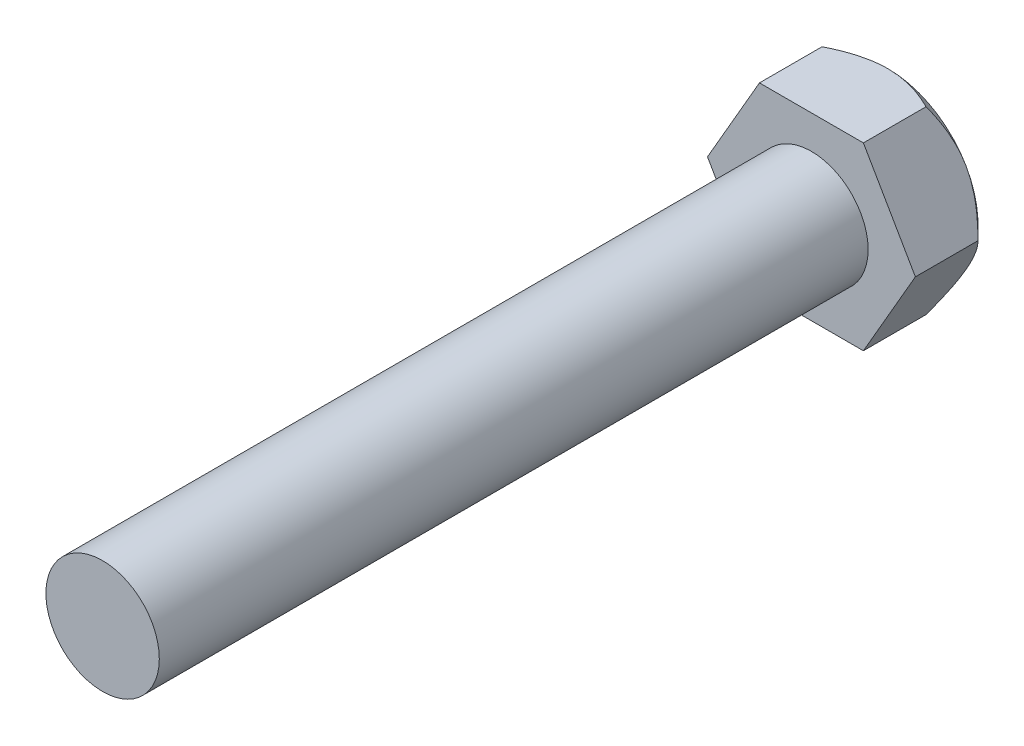
ISO-10303-21;
HEADER;
FILE_DESCRIPTION(('STEP AP214'),'2;1');
FILE_NAME('part.step','',(''),(''),'','','');
FILE_SCHEMA(('AUTOMOTIVE_DESIGN { 1 0 10303 214 1 1 1 1 }'));
ENDSEC;
DATA;
#1=APPLICATION_CONTEXT('core data for automotive mechanical design processes');
#2=APPLICATION_PROTOCOL_DEFINITION('international standard','automotive_design',2000,#1);
#3=PRODUCT_CONTEXT('',#1,'mechanical');
#4=PRODUCT('Part','Part','',(#3));
#5=PRODUCT_RELATED_PRODUCT_CATEGORY('part','',(#4));
#6=PRODUCT_DEFINITION_FORMATION('','',#4);
#7=PRODUCT_DEFINITION_CONTEXT('part definition',#1,'design');
#8=PRODUCT_DEFINITION('design','',#6,#7);
#9=PRODUCT_DEFINITION_SHAPE('','',#8);
#10=(LENGTH_UNIT() NAMED_UNIT(*) SI_UNIT(.MILLI.,.METRE.));
#11=(NAMED_UNIT(*) PLANE_ANGLE_UNIT() SI_UNIT($,.RADIAN.));
#12=(NAMED_UNIT(*) SI_UNIT($,.STERADIAN.) SOLID_ANGLE_UNIT());
#13=UNCERTAINTY_MEASURE_WITH_UNIT(LENGTH_MEASURE(1.E-05),#10,'distance_accuracy_value','');
#14=(GEOMETRIC_REPRESENTATION_CONTEXT(3) GLOBAL_UNCERTAINTY_ASSIGNED_CONTEXT((#13)) GLOBAL_UNIT_ASSIGNED_CONTEXT((#10,
#11,#12)) REPRESENTATION_CONTEXT('',''));
#15=CARTESIAN_POINT('',(0.,0.,0.));
#16=DIRECTION('',(0.,0.,1.));
#17=DIRECTION('',(1.,0.,0.));
#18=AXIS2_PLACEMENT_3D('',#15,#16,#17);
#19=CARTESIAN_POINT('',(-3.66617420935413,-6.35000000000001,5.4));
#20=DIRECTION('',(0.,1.,0.));
#21=DIRECTION('',(-1.,0.,0.));
#22=AXIS2_PLACEMENT_3D('',#19,#20,#21);
#23=PLANE('',#22);
#24=CARTESIAN_POINT('',(-8.36271738258766,-6.35000000000001,4.15035913771684));
#25=CARTESIAN_POINT('',(-8.16311598402678,-6.35000000000001,3.99142669158662));
#26=CARTESIAN_POINT('',(-7.96252402767748,-6.35000000000001,3.8337201032396));
#27=CARTESIAN_POINT('',(-7.55892696270598,-6.35000000000001,3.52134012428512));
#28=CARTESIAN_POINT('',(-7.35592135582016,-6.35000000000001,3.36666737806689));
#29=CARTESIAN_POINT('',(-6.94560042810555,-6.35000000000001,3.05984628365542));
#30=CARTESIAN_POINT('',(-6.73826411061342,-6.35000000000001,2.90772592971827));
#31=CARTESIAN_POINT('',(-6.32030001928075,-6.35000000000001,2.60809403893614));
#32=CARTESIAN_POINT('',(-6.10967246535052,-6.35000000000001,2.46058219612327));
#33=CARTESIAN_POINT('',(-5.66815825005391,-6.35000000000001,2.16013225127638));
#34=CARTESIAN_POINT('',(-5.43695982915491,-6.35000000000001,2.00765004566542));
#35=CARTESIAN_POINT('',(-4.969114792793,-6.35000000000001,1.71113154823421));
#36=CARTESIAN_POINT('',(-4.73246716601003,-6.35000000000001,1.56709684207155));
#37=CARTESIAN_POINT('',(-4.25348748170774,-6.35000000000001,1.29045375796301));
#38=CARTESIAN_POINT('',(-4.01117472490868,-6.35000000000001,1.15781222264333));
#39=CARTESIAN_POINT('',(-3.51926467594557,-6.35000000000001,0.906926770877128));
#40=CARTESIAN_POINT('',(-3.2696711557254,-6.35000000000001,0.788675557875978));
#41=CARTESIAN_POINT('',(-2.79536673841799,-6.35000000000001,0.585193123342967));
#42=CARTESIAN_POINT('',(-2.57165028535743,-6.35000000000001,0.497667130040733));
#43=CARTESIAN_POINT('',(-2.11790258910196,-6.35000000000001,0.340497668316637));
#44=CARTESIAN_POINT('',(-1.88787098748689,-6.35,0.270855217218452));
#45=CARTESIAN_POINT('',(-1.4272808687207,-6.35,0.15470018681736));
#46=CARTESIAN_POINT('',(-1.19684351403066,-6.35,0.10771579711351));
#47=CARTESIAN_POINT('',(-0.732310723235208,-6.35,0.0379697045515682));
#48=CARTESIAN_POINT('',(-0.498216401714363,-6.35,0.0152007619281005));
#49=CARTESIAN_POINT('',(-0.0435029930437127,-6.35,-0.00366069564380835));
#50=CARTESIAN_POINT('',(0.177050962039928,-6.35,-0.00132075635617045));
#51=CARTESIAN_POINT('',(0.616729534456308,-6.35,0.0261031699289112));
#52=CARTESIAN_POINT('',(0.835854042878321,-6.35,0.0511888700224876));
#53=CARTESIAN_POINT('',(1.27484408751909,-6.35,0.12301118260166));
#54=CARTESIAN_POINT('',(1.49464086737572,-6.35,0.170160142480889));
#55=CARTESIAN_POINT('',(1.9292485358784,-6.35,0.283281179668719));
#56=CARTESIAN_POINT('',(2.14405940354614,-6.35,0.349253336160702));
#57=CARTESIAN_POINT('',(2.56843249702076,-6.35,0.496874515742023));
#58=CARTESIAN_POINT('',(2.77798824080846,-6.35,0.578541917408304));
#59=CARTESIAN_POINT('',(3.19175304891481,-6.35,0.754555069585721));
#60=CARTESIAN_POINT('',(3.39595976714007,-6.35,0.848906275561007));
#61=CARTESIAN_POINT('',(3.79995359601183,-6.35,1.04805124392585));
#62=CARTESIAN_POINT('',(3.99972521313765,-6.35,1.15287617692551));
#63=CARTESIAN_POINT('',(4.39470826318374,-6.35,1.37067509685678));
#64=CARTESIAN_POINT('',(4.58992036376844,-6.35,1.48364788064258));
#65=CARTESIAN_POINT('',(4.96682462847147,-6.35,1.71041754556526));
#66=CARTESIAN_POINT('',(5.14870823944139,-6.35,1.82389791770327));
#67=CARTESIAN_POINT('',(5.50935016902257,-6.35,2.05573443754703));
#68=CARTESIAN_POINT('',(5.68810825651993,-6.35,2.1740909436603));
#69=CARTESIAN_POINT('',(6.04148934498121,-6.35,2.41386611689876));
#70=CARTESIAN_POINT('',(6.21613386154989,-6.35,2.53525318857568));
#71=CARTESIAN_POINT('',(6.56302063028451,-6.35,2.78131666853412));
#72=CARTESIAN_POINT('',(6.73526353013055,-6.35,2.90599216268269));
#73=CARTESIAN_POINT('',(6.90649741015199,-6.35,3.03201505415739));
#74=B_SPLINE_CURVE_WITH_KNOTS('',3,(#24,#25,#26,#27,#28,#29,#30,#31,#32,#33,#34,#35,#36,#37,#38,
#39,#40,#41,#42,#43,#44,#45,#46,#47,#48,#49,#50,#51,#52,#53,#54,#55,#56,#57,#58,#59,#60,#61,#62,
#63,#64,#65,#66,#67,#68,#69,#70,#71,#72,#73),.UNSPECIFIED.,.F.,.F.,(4,2,2,2,2,2,2,2,2,2,2,2,2,2,
2,2,2,2,2,2,2,2,2,2,4),(0.,0.765454423513971,1.53106970675986,2.30248401021557,3.07384698868581,
3.90456567084917,4.73543978919794,5.56380753911343,6.39175350281366,7.11183813688834,
7.83196372464763,8.53636634207506,9.24055830287082,9.90105696926376,10.5616053852217,
11.2350246999706,11.9084468476287,12.5826624070439,13.2571688884655,13.9337461877098,
14.6102237844597,15.2532775002049,15.8963785665587,16.5343968207186,17.1722395465762),.UNSPECIFIED.);
#75=CARTESIAN_POINT('',(3.66617420935413,-6.35,0.982348418708244));
#76=VERTEX_POINT('',#75);
#77=CARTESIAN_POINT('',(0.,-6.35,0.));
#78=VERTEX_POINT('',#77);
#79=EDGE_CURVE('E224',#76,#78,#74,.F.);
#80=ORIENTED_EDGE('',*,*,#79,.F.);
#81=DIRECTION('',(0.,0.,-1.));
#82=VECTOR('',#81,1.);
#83=CARTESIAN_POINT('',(3.66617420935413,-6.35,5.4));
#84=LINE('',#83,#82);
#85=CARTESIAN_POINT('',(3.66617420935413,-6.35,5.4));
#86=VERTEX_POINT('',#85);
#87=EDGE_CURVE('E129',#86,#76,#84,.T.);
#88=ORIENTED_EDGE('',*,*,#87,.F.);
#89=DIRECTION('',(1.,0.,0.));
#90=VECTOR('',#89,1.);
#91=CARTESIAN_POINT('',(-3.66617420935413,-6.35000000000001,5.4));
#92=LINE('',#91,#90);
#93=CARTESIAN_POINT('',(-3.66617420935413,-6.35000000000001,5.4));
#94=VERTEX_POINT('',#93);
#95=EDGE_CURVE('E253',#94,#86,#92,.T.);
#96=ORIENTED_EDGE('',*,*,#95,.F.);
#97=DIRECTION('',(0.,0.,-1.));
#98=VECTOR('',#97,1.);
#99=CARTESIAN_POINT('',(-3.66617420935413,-6.35000000000001,5.4));
#100=LINE('',#99,#98);
#101=CARTESIAN_POINT('',(-3.66617420935413,-6.35000000000001,0.982348418708246));
#102=VERTEX_POINT('',#101);
#103=EDGE_CURVE('E242',#94,#102,#100,.T.);
#104=ORIENTED_EDGE('',*,*,#103,.T.);
#105=EDGE_CURVE('E179',#78,#102,#74,.F.);
#106=ORIENTED_EDGE('',*,*,#105,.F.);
#107=EDGE_LOOP('',(#80,#88,#96,#104,#106));
#108=FACE_BOUND('',#107,.T.);
#109=ADVANCED_FACE('F34',(#108),#23,.F.);
#110=CARTESIAN_POINT('',(3.66617420935413,-6.35,5.4));
#111=DIRECTION('',(-0.866025403784439,0.5,0.));
#112=DIRECTION('',(-0.5,-0.866025403784439,0.));
#113=AXIS2_PLACEMENT_3D('',#110,#111,#112);
#114=PLANE('',#113);
#115=CARTESIAN_POINT('',(7.33246388876209,0.00020000000000105,0.982463891489679));
#116=CARTESIAN_POINT('',(7.26942659957829,-0.108983787637754,0.919433086318357));
#117=CARTESIAN_POINT('',(7.20590477632729,-0.219006812897904,0.858336605718883));
#118=CARTESIAN_POINT('',(7.07779700421365,-0.440895983043184,0.740600705144795));
#119=CARTESIAN_POINT('',(7.01321049713028,-0.552763094794977,0.683963719413411));
#120=CARTESIAN_POINT('',(6.81711135032452,-0.892416780383471,0.521141651919389));
#121=CARTESIAN_POINT('',(6.68393864145051,-1.12307867833483,0.422740057165401));
#122=CARTESIAN_POINT('',(6.4153852290923,-1.58822683308524,0.254234127074027));
#123=CARTESIAN_POINT('',(6.28007316473073,-1.82259420343652,0.183705271348863));
#124=CARTESIAN_POINT('',(6.07488050762847,-2.17799831087769,0.102120727501205));
#125=CARTESIAN_POINT('',(6.00618085822826,-2.29698959410101,0.0789715798181042));
#126=CARTESIAN_POINT('',(5.86819987727892,-2.53597966358347,0.0412667055874418));
#127=CARTESIAN_POINT('',(5.79891863422972,-2.65597829655621,0.0267096947979048));
#128=CARTESIAN_POINT('',(5.63008960560986,-2.9483987519183,0.00230276096296714));
#129=CARTESIAN_POINT('',(5.53035991347792,-3.12113564571404,-0.00281825558985862));
#130=CARTESIAN_POINT('',(5.331080278806,-3.46629809787957,0.00577721610568232));
#131=CARTESIAN_POINT('',(5.23153041152107,-3.6387235259038,0.0195003076033654));
#132=CARTESIAN_POINT('',(5.03336921888567,-3.98194877963676,0.0649750712386902));
#133=CARTESIAN_POINT('',(4.93475906870367,-4.15274656989399,0.0967469046312839));
#134=CARTESIAN_POINT('',(4.73923363674912,-4.49140655221111,0.176591835539256));
#135=CARTESIAN_POINT('',(4.64231822561383,-4.65926896833386,0.224663683080585));
#136=CARTESIAN_POINT('',(4.47027640547049,-4.95725414184875,0.323561992648245));
#137=CARTESIAN_POINT('',(4.39476903577339,-5.08803674251001,0.37178741127071));
#138=CARTESIAN_POINT('',(4.24510973512911,-5.34725425505113,0.476009582289464));
#139=CARTESIAN_POINT('',(4.17095784535659,-5.47568909561438,0.532006570315947));
#140=CARTESIAN_POINT('',(4.02424305808161,-5.72980656139631,0.65051664201107));
#141=CARTESIAN_POINT('',(3.95167598793822,-5.85549641384107,0.713009233970375));
#142=CARTESIAN_POINT('',(3.80788558067148,-6.10454870486808,0.843690064526779));
#143=CARTESIAN_POINT('',(3.73666145187464,-6.22791251466904,0.911874810130715));
#144=CARTESIAN_POINT('',(3.66605873930029,-6.3502,0.982463891489678));
#145=B_SPLINE_CURVE_WITH_KNOTS('',3,(#115,#116,#117,#118,#119,#120,#121,#122,#123,#124,#125,
#126,#127,#128,#129,#130,#131,#132,#133,#134,#135,#136,#137,#138,#139,#140,#141,#142,#143,#144),
.UNSPECIFIED.,.F.,.F.,(4,2,2,2,2,2,2,2,2,2,2,2,2,2,4),(0.,0.422833549986454,0.845896328892868,
1.69658934745269,2.5337742303783,2.95154563240733,3.36925457552424,3.96689987236253,
4.56475464624894,5.16327856767162,5.76175660138971,6.23711762004977,6.71249305457399,
7.18641189114168,7.6600420153122),.UNSPECIFIED.);
#146=CARTESIAN_POINT('',(7.33234841870825,0.,0.982348418708245));
#147=VERTEX_POINT('',#146);
#148=CARTESIAN_POINT('',(5.49926131403119,-3.175,0.));
#149=VERTEX_POINT('',#148);
#150=EDGE_CURVE('E124',#147,#149,#145,.T.);
#151=ORIENTED_EDGE('',*,*,#150,.F.);
#152=DIRECTION('',(0.,0.,-1.));
#153=VECTOR('',#152,1.);
#154=CARTESIAN_POINT('',(7.33234841870825,0.,5.4));
#155=LINE('',#154,#153);
#156=CARTESIAN_POINT('',(7.33234841870825,0.,5.4));
#157=VERTEX_POINT('',#156);
#158=EDGE_CURVE('E137',#157,#147,#155,.T.);
#159=ORIENTED_EDGE('',*,*,#158,.F.);
#160=DIRECTION('',(0.5,0.866025403784439,0.));
#161=VECTOR('',#160,1.);
#162=CARTESIAN_POINT('',(3.66617420935413,-6.35,5.4));
#163=LINE('',#162,#161);
#164=EDGE_CURVE('E230',#86,#157,#163,.T.);
#165=ORIENTED_EDGE('',*,*,#164,.F.);
#166=ORIENTED_EDGE('',*,*,#87,.T.);
#167=EDGE_CURVE('E146',#149,#76,#145,.T.);
#168=ORIENTED_EDGE('',*,*,#167,.F.);
#169=EDGE_LOOP('',(#151,#159,#165,#166,#168));
#170=FACE_BOUND('',#169,.T.);
#171=ADVANCED_FACE('F215',(#170),#114,.F.);
#172=CARTESIAN_POINT('',(7.33234841870825,0.,5.4));
#173=DIRECTION('',(-0.866025403784439,-0.5,0.));
#174=DIRECTION('',(0.5,-0.866025403784439,0.));
#175=AXIS2_PLACEMENT_3D('',#172,#173,#174);
#176=PLANE('',#175);
#177=CARTESIAN_POINT('',(3.66605873930029,6.35020000000001,0.982463891489679));
#178=CARTESIAN_POINT('',(3.72909602848409,6.24101621236225,0.919433086318357));
#179=CARTESIAN_POINT('',(3.7926178517351,6.1309931871021,0.858336605718884));
#180=CARTESIAN_POINT('',(3.92072562384874,5.90910401695682,0.740600705144795));
#181=CARTESIAN_POINT('',(3.9853121309321,5.79723690520503,0.683963719413411));
#182=CARTESIAN_POINT('',(4.18141127773786,5.45758321961653,0.521141651919389));
#183=CARTESIAN_POINT('',(4.31458398661187,5.22692132166517,0.422740057165402));
#184=CARTESIAN_POINT('',(4.58313739897008,4.76177316691476,0.254234127074028));
#185=CARTESIAN_POINT('',(4.71844946333165,4.52740579656349,0.183705271348863));
#186=CARTESIAN_POINT('',(4.92364212043392,4.17200168912231,0.102120727501206));
#187=CARTESIAN_POINT('',(4.99234176983412,4.05301040589899,0.0789715798181047));
#188=CARTESIAN_POINT('',(5.13032275078347,3.81402033641653,0.0412667055874423));
#189=CARTESIAN_POINT('',(5.19960399383266,3.69402170344379,0.0267096947979052));
#190=CARTESIAN_POINT('',(5.36843302245252,3.4016012480817,0.00230276096296804));
#191=CARTESIAN_POINT('',(5.46816271458447,3.22886435428596,-0.00281825558985712));
#192=CARTESIAN_POINT('',(5.66744234925639,2.88370190212043,0.00577721610568428));
#193=CARTESIAN_POINT('',(5.76699221654131,2.7112764740962,0.0195003076033672));
#194=CARTESIAN_POINT('',(5.96515340917671,2.36805122036324,0.0649750712386918));
#195=CARTESIAN_POINT('',(6.06376355935872,2.19725343010601,0.0967469046312856));
#196=CARTESIAN_POINT('',(6.25928899131327,1.85859344778888,0.176591835539259));
#197=CARTESIAN_POINT('',(6.35620440244856,1.69073103166614,0.224663683080589));
#198=CARTESIAN_POINT('',(6.5282462225919,1.39274585815125,0.323561992648249));
#199=CARTESIAN_POINT('',(6.60375359228899,1.26196325748999,0.371787411270714));
#200=CARTESIAN_POINT('',(6.75341289293327,1.00274574494887,0.476009582289467));
#201=CARTESIAN_POINT('',(6.82756478270579,0.874310904385622,0.53200657031595));
#202=CARTESIAN_POINT('',(6.97427956998077,0.620193438603691,0.650516642011073));
#203=CARTESIAN_POINT('',(7.04684664012416,0.494503586158933,0.713009233970377));
#204=CARTESIAN_POINT('',(7.1906370473909,0.245451295131921,0.843690064526779));
#205=CARTESIAN_POINT('',(7.26186117618774,0.122087485330964,0.911874810130715));
#206=CARTESIAN_POINT('',(7.33246388876209,-0.000199999999999351,0.982463891489679));
#207=B_SPLINE_CURVE_WITH_KNOTS('',3,(#177,#178,#179,#180,#181,#182,#183,#184,#185,#186,#187,
#188,#189,#190,#191,#192,#193,#194,#195,#196,#197,#198,#199,#200,#201,#202,#203,#204,#205,#206),
.UNSPECIFIED.,.F.,.F.,(4,2,2,2,2,2,2,2,2,2,2,2,2,2,4),(0.,0.422833549986454,0.845896328892868,
1.69658934745269,2.5337742303783,2.95154563240734,3.36925457552424,3.96689987236253,
4.56475464624895,5.16327856767162,5.76175660138972,6.23711762004977,6.71249305457399,
7.18641189114168,7.6600420153122),.UNSPECIFIED.);
#208=CARTESIAN_POINT('',(3.66617420935413,6.35000000000001,0.982348418708246));
#209=VERTEX_POINT('',#208);
#210=CARTESIAN_POINT('',(5.49926131403119,3.175,0.));
#211=VERTEX_POINT('',#210);
#212=EDGE_CURVE('E105',#209,#211,#207,.T.);
#213=ORIENTED_EDGE('',*,*,#212,.F.);
#214=DIRECTION('',(0.,0.,-1.));
#215=VECTOR('',#214,1.);
#216=CARTESIAN_POINT('',(3.66617420935413,6.35000000000001,5.4));
#217=LINE('',#216,#215);
#218=CARTESIAN_POINT('',(3.66617420935413,6.35000000000001,5.4));
#219=VERTEX_POINT('',#218);
#220=EDGE_CURVE('E232',#219,#209,#217,.T.);
#221=ORIENTED_EDGE('',*,*,#220,.F.);
#222=DIRECTION('',(-0.5,0.866025403784439,0.));
#223=VECTOR('',#222,1.);
#224=CARTESIAN_POINT('',(7.33234841870825,0.,5.4));
#225=LINE('',#224,#223);
#226=EDGE_CURVE('E250',#157,#219,#225,.T.);
#227=ORIENTED_EDGE('',*,*,#226,.F.);
#228=ORIENTED_EDGE('',*,*,#158,.T.);
#229=EDGE_CURVE('E117',#211,#147,#207,.T.);
#230=ORIENTED_EDGE('',*,*,#229,.F.);
#231=EDGE_LOOP('',(#213,#221,#227,#228,#230));
#232=FACE_BOUND('',#231,.T.);
#233=ADVANCED_FACE('F134',(#232),#176,.F.);
#234=CARTESIAN_POINT('',(3.66617420935413,6.35000000000001,5.4));
#235=DIRECTION('',(0.,-1.,0.));
#236=DIRECTION('',(1.,0.,0.));
#237=AXIS2_PLACEMENT_3D('',#234,#235,#236);
#238=PLANE('',#237);
#239=CARTESIAN_POINT('',(-8.36271737268808,6.35,4.1503591298326));
#240=CARTESIAN_POINT('',(-8.16311597442625,6.35,3.99142668400926));
#241=CARTESIAN_POINT('',(-7.96252401837674,6.35,3.83372009596871));
#242=CARTESIAN_POINT('',(-7.55892695400737,6.35,3.52134011762556));
#243=CARTESIAN_POINT('',(-7.35592134742387,6.35,3.36666737171217));
#244=CARTESIAN_POINT('',(-6.94560042032332,6.35,3.05984627791292));
#245=CARTESIAN_POINT('',(-6.73826410314301,6.35,2.90772592428305));
#246=CARTESIAN_POINT('',(-6.32030001243879,6.35,2.60809403411109));
#247=CARTESIAN_POINT('',(-6.10967245882522,6.35,2.46058219160111));
#248=CARTESIAN_POINT('',(-5.66815824421438,6.35,2.16013224739065));
#249=CARTESIAN_POINT('',(-5.43695982368546,6.35,2.00765004211209));
#250=CARTESIAN_POINT('',(-4.96911478807629,6.35,1.71113154533164));
#251=CARTESIAN_POINT('',(-4.73246716167599,6.35,1.56709683948733));
#252=CARTESIAN_POINT('',(-4.25348747815246,6.35,1.29045375599041));
#253=CARTESIAN_POINT('',(-4.01117472174939,6.35,1.15781222096416));
#254=CARTESIAN_POINT('',(-3.51926467360035,6.35,0.906926769748841));
#255=CARTESIAN_POINT('',(-3.26967115379824,6.35,0.788675557005189));
#256=CARTESIAN_POINT('',(-2.79536673665958,6.35,0.58519312262682));
#257=CARTESIAN_POINT('',(-2.57165028332852,6.35,0.497667129269865));
#258=CARTESIAN_POINT('',(-2.11790258651886,6.35,0.340497667489929));
#259=CARTESIAN_POINT('',(-1.88787098462011,6.35,0.270855216390592));
#260=CARTESIAN_POINT('',(-1.42728086529415,6.35,0.154700186055691));
#261=CARTESIAN_POINT('',(-1.19684351032839,6.35,0.107715796416926));
#262=CARTESIAN_POINT('',(-0.73231071898595,6.35,0.0379697040539988));
#263=CARTESIAN_POINT('',(-0.498216397193842,6.35,0.0152007615644111));
#264=CARTESIAN_POINT('',(-0.0435029881194474,6.35,-0.00366069568275363));
#265=CARTESIAN_POINT('',(0.177050967097276,6.35000000000001,-0.00132075621896808));
#266=CARTESIAN_POINT('',(0.616729539760015,6.35000000000001,0.0261031704380404));
#267=CARTESIAN_POINT('',(0.835854048295298,6.35000000000001,0.0511888707274244));
#268=CARTESIAN_POINT('',(1.27484409315934,6.35000000000001,0.12301118370953));
#269=CARTESIAN_POINT('',(1.4946408731254,6.35000000000001,0.170160143797308));
#270=CARTESIAN_POINT('',(1.92924854183185,6.35000000000001,0.283281181398669));
#271=CARTESIAN_POINT('',(2.14405940959394,6.35000000000001,0.349253338095628));
#272=CARTESIAN_POINT('',(2.56843250373335,6.35000000000001,0.496874518246232));
#273=CARTESIAN_POINT('',(2.7779882480789,6.35000000000001,0.578541920312497));
#274=CARTESIAN_POINT('',(3.19175305727264,6.35000000000001,0.754555073329868));
#275=CARTESIAN_POINT('',(3.39595977602741,6.35000000000001,0.848906279745168));
#276=CARTESIAN_POINT('',(3.79995360593908,6.35000000000001,1.04805124901678));
#277=CARTESIAN_POINT('',(3.99972522357521,6.35000000000001,1.15287618248335));
#278=CARTESIAN_POINT('',(4.3947082746251,6.35000000000001,1.37067510336321));
#279=CARTESIAN_POINT('',(4.58992037570332,6.35000000000001,1.48364788763069));
#280=CARTESIAN_POINT('',(4.9668246412989,6.35000000000001,1.71041755346615));
#281=CARTESIAN_POINT('',(5.14870825266958,6.35000000000001,1.82389792603297));
#282=CARTESIAN_POINT('',(5.50935018304649,6.35000000000001,2.0557344467361));
#283=CARTESIAN_POINT('',(5.68810827093883,6.35000000000001,2.17409095327991));
#284=CARTESIAN_POINT('',(6.0414893601804,6.35000000000001,2.41386612737455));
#285=CARTESIAN_POINT('',(6.21613387713448,6.35000000000001,2.53525319947702));
#286=CARTESIAN_POINT('',(6.56302064663733,6.35000000000001,2.78131668028598));
#287=CARTESIAN_POINT('',(6.73526354686621,6.35000000000001,2.90599217485951));
#288=CARTESIAN_POINT('',(6.90649742726982,6.35000000000001,3.03201506675855));
#289=B_SPLINE_CURVE_WITH_KNOTS('',3,(#239,#240,#241,#242,#243,#244,#245,#246,#247,#248,#249,
#250,#251,#252,#253,#254,#255,#256,#257,#258,#259,#260,#261,#262,#263,#264,#265,#266,#267,#268,
#269,#270,#271,#272,#273,#274,#275,#276,#277,#278,#279,#280,#281,#282,#283,#284,#285,#286,#287,
#288),.UNSPECIFIED.,.F.,.F.,(4,2,2,2,2,2,2,2,2,2,2,2,2,2,2,2,2,2,2,2,2,2,2,2,4),(0.,
0.765454422238654,1.53106970420886,2.30248400636505,3.073846983536,3.90456566422371,
4.73543978109585,5.5638075295475,6.39175349178652,7.11183812667386,7.83196371524441,
8.5363663334381,9.24055829499907,9.90105696179485,10.5616053781564,11.2350246933577,
11.9084468414678,12.5826624028753,13.2571688862916,13.9337461875419,14.6102237862969,
15.2532775037431,15.8963785717981,16.534396827636,17.1722395551716),.UNSPECIFIED.);
#290=CARTESIAN_POINT('',(-3.66617420935413,6.35,0.982348418708245));
#291=VERTEX_POINT('',#290);
#292=CARTESIAN_POINT('',(0.,6.35,0.));
#293=VERTEX_POINT('',#292);
#294=EDGE_CURVE('E50',#291,#293,#289,.T.);
#295=ORIENTED_EDGE('',*,*,#294,.F.);
#296=DIRECTION('',(0.,0.,-1.));
#297=VECTOR('',#296,1.);
#298=CARTESIAN_POINT('',(-3.66617420935413,6.35,5.4));
#299=LINE('',#298,#297);
#300=CARTESIAN_POINT('',(-3.66617420935413,6.35,5.4));
#301=VERTEX_POINT('',#300);
#302=EDGE_CURVE('E236',#301,#291,#299,.T.);
#303=ORIENTED_EDGE('',*,*,#302,.F.);
#304=DIRECTION('',(-1.,0.,0.));
#305=VECTOR('',#304,1.);
#306=CARTESIAN_POINT('',(3.66617420935413,6.35000000000001,5.4));
#307=LINE('',#306,#305);
#308=EDGE_CURVE('E248',#219,#301,#307,.T.);
#309=ORIENTED_EDGE('',*,*,#308,.F.);
#310=ORIENTED_EDGE('',*,*,#220,.T.);
#311=EDGE_CURVE('E111',#293,#209,#289,.T.);
#312=ORIENTED_EDGE('',*,*,#311,.F.);
#313=EDGE_LOOP('',(#295,#303,#309,#310,#312));
#314=FACE_BOUND('',#313,.T.);
#315=ADVANCED_FACE('F187',(#314),#238,.F.);
#316=CARTESIAN_POINT('',(-3.66617420935413,6.35,5.4));
#317=DIRECTION('',(0.866025403784439,-0.5,0.));
#318=DIRECTION('',(0.5,0.866025403784439,0.));
#319=AXIS2_PLACEMENT_3D('',#316,#317,#318);
#320=PLANE('',#319);
#321=CARTESIAN_POINT('',(-7.33246388876209,-0.000199999999999519,0.982463891489678));
#322=CARTESIAN_POINT('',(-7.26942659957829,0.108983787637755,0.919433086318355));
#323=CARTESIAN_POINT('',(-7.20590477632729,0.219006812897905,0.858336605718882));
#324=CARTESIAN_POINT('',(-7.07779700421364,0.440895983043186,0.740600705144794));
#325=CARTESIAN_POINT('',(-7.01321049713028,0.552763094794978,0.68396371941341));
#326=CARTESIAN_POINT('',(-6.81711135032452,0.892416780383472,0.521141651919389));
#327=CARTESIAN_POINT('',(-6.68393864145051,1.12307867833483,0.4227400571654));
#328=CARTESIAN_POINT('',(-6.4153852290923,1.58822683308524,0.254234127074026));
#329=CARTESIAN_POINT('',(-6.28007316473073,1.82259420343652,0.183705271348863));
#330=CARTESIAN_POINT('',(-6.07488050762847,2.17799831087769,0.102120727501205));
#331=CARTESIAN_POINT('',(-6.00618085822826,2.29698959410101,0.0789715798181031));
#332=CARTESIAN_POINT('',(-5.86819987727892,2.53597966358347,0.0412667055874404));
#333=CARTESIAN_POINT('',(-5.79891863422972,2.65597829655621,0.0267096947979038));
#334=CARTESIAN_POINT('',(-5.63008960560986,2.94839875191831,0.00230276096296735));
#335=CARTESIAN_POINT('',(-5.53035991347791,3.12113564571404,-0.00281825558985779));
#336=CARTESIAN_POINT('',(-5.331080278806,3.46629809787957,0.00577721610568321));
#337=CARTESIAN_POINT('',(-5.23153041152107,3.6387235259038,0.0195003076033658));
#338=CARTESIAN_POINT('',(-5.03336921888567,3.98194877963676,0.0649750712386898));
#339=CARTESIAN_POINT('',(-4.93475906870366,4.15274656989399,0.0967469046312834));
#340=CARTESIAN_POINT('',(-4.73923363674912,4.49140655221112,0.176591835539257));
#341=CARTESIAN_POINT('',(-4.64231822561383,4.65926896833386,0.224663683080587));
#342=CARTESIAN_POINT('',(-4.47027640547049,4.95725414184876,0.323561992648247));
#343=CARTESIAN_POINT('',(-4.39476903577339,5.08803674251001,0.371787411270711));
#344=CARTESIAN_POINT('',(-4.24510973512911,5.34725425505113,0.476009582289464));
#345=CARTESIAN_POINT('',(-4.17095784535659,5.47568909561438,0.532006570315948));
#346=CARTESIAN_POINT('',(-4.02424305808161,5.72980656139631,0.650516642011071));
#347=CARTESIAN_POINT('',(-3.95167598793822,5.85549641384107,0.713009233970376));
#348=CARTESIAN_POINT('',(-3.80788558067148,6.10454870486808,0.843690064526779));
#349=CARTESIAN_POINT('',(-3.73666145187464,6.22791251466904,0.911874810130715));
#350=CARTESIAN_POINT('',(-3.66605873930029,6.3502,0.982463891489679));
#351=B_SPLINE_CURVE_WITH_KNOTS('',3,(#321,#322,#323,#324,#325,#326,#327,#328,#329,#330,#331,
#332,#333,#334,#335,#336,#337,#338,#339,#340,#341,#342,#343,#344,#345,#346,#347,#348,#349,#350),
.UNSPECIFIED.,.F.,.F.,(4,2,2,2,2,2,2,2,2,2,2,2,2,2,4),(0.,0.422833549986454,0.845896328892868,
1.69658934745269,2.5337742303783,2.95154563240733,3.36925457552424,3.96689987236253,
4.56475464624895,5.16327856767162,5.76175660138972,6.23711762004977,6.71249305457399,
7.18641189114168,7.6600420153122),.UNSPECIFIED.);
#352=CARTESIAN_POINT('',(-7.33234841870825,0.,0.982348418708244));
#353=VERTEX_POINT('',#352);
#354=CARTESIAN_POINT('',(-5.49926131403119,3.175,0.));
#355=VERTEX_POINT('',#354);
#356=EDGE_CURVE('E57',#353,#355,#351,.T.);
#357=ORIENTED_EDGE('',*,*,#356,.F.);
#358=DIRECTION('',(0.,0.,-1.));
#359=VECTOR('',#358,1.);
#360=CARTESIAN_POINT('',(-7.33234841870825,0.,5.4));
#361=LINE('',#360,#359);
#362=CARTESIAN_POINT('',(-7.33234841870825,0.,5.4));
#363=VERTEX_POINT('',#362);
#364=EDGE_CURVE('E239',#363,#353,#361,.T.);
#365=ORIENTED_EDGE('',*,*,#364,.F.);
#366=DIRECTION('',(-0.5,-0.866025403784439,0.));
#367=VECTOR('',#366,1.);
#368=CARTESIAN_POINT('',(-3.66617420935413,6.35,5.4));
#369=LINE('',#368,#367);
#370=EDGE_CURVE('E246',#301,#363,#369,.T.);
#371=ORIENTED_EDGE('',*,*,#370,.F.);
#372=ORIENTED_EDGE('',*,*,#302,.T.);
#373=EDGE_CURVE('E186',#355,#291,#351,.T.);
#374=ORIENTED_EDGE('',*,*,#373,.F.);
#375=EDGE_LOOP('',(#357,#365,#371,#372,#374));
#376=FACE_BOUND('',#375,.T.);
#377=ADVANCED_FACE('F190',(#376),#320,.F.);
#378=CARTESIAN_POINT('',(-7.33234841870825,0.,5.4));
#379=DIRECTION('',(0.866025403784439,0.5,0.));
#380=DIRECTION('',(-0.5,0.866025403784439,0.));
#381=AXIS2_PLACEMENT_3D('',#378,#379,#380);
#382=PLANE('',#381);
#383=CARTESIAN_POINT('',(-3.66605873930029,-6.35020000000001,0.982463891489679));
#384=CARTESIAN_POINT('',(-3.72909602848409,-6.24101621236225,0.919433086318356));
#385=CARTESIAN_POINT('',(-3.7926178517351,-6.1309931871021,0.858336605718883));
#386=CARTESIAN_POINT('',(-3.92072562384874,-5.90910401695682,0.740600705144795));
#387=CARTESIAN_POINT('',(-3.9853121309321,-5.79723690520503,0.683963719413411));
#388=CARTESIAN_POINT('',(-4.18141127773787,-5.45758321961653,0.52114165191939));
#389=CARTESIAN_POINT('',(-4.31458398661187,-5.22692132166517,0.422740057165401));
#390=CARTESIAN_POINT('',(-4.58313739897008,-4.76177316691476,0.254234127074027));
#391=CARTESIAN_POINT('',(-4.71844946333165,-4.52740579656349,0.183705271348863));
#392=CARTESIAN_POINT('',(-4.92364212043392,-4.17200168912231,0.102120727501205));
#393=CARTESIAN_POINT('',(-4.99234176983412,-4.05301040589899,0.078971579818104));
#394=CARTESIAN_POINT('',(-5.13032275078346,-3.81402033641653,0.0412667055874413));
#395=CARTESIAN_POINT('',(-5.19960399383266,-3.69402170344379,0.0267096947979042));
#396=CARTESIAN_POINT('',(-5.36843302245252,-3.4016012480817,0.00230276096296701));
#397=CARTESIAN_POINT('',(-5.46816271458447,-3.22886435428596,-0.00281825558985793));
#398=CARTESIAN_POINT('',(-5.66744234925639,-2.88370190212043,0.00577721610568336));
#399=CARTESIAN_POINT('',(-5.76699221654131,-2.7112764740962,0.019500307603366));
#400=CARTESIAN_POINT('',(-5.96515340917671,-2.36805122036324,0.0649750712386905));
#401=CARTESIAN_POINT('',(-6.06376355935872,-2.19725343010601,0.0967469046312845));
#402=CARTESIAN_POINT('',(-6.25928899131327,-1.85859344778889,0.176591835539257));
#403=CARTESIAN_POINT('',(-6.35620440244856,-1.69073103166614,0.224663683080587));
#404=CARTESIAN_POINT('',(-6.52824622259189,-1.39274585815125,0.323561992648247));
#405=CARTESIAN_POINT('',(-6.60375359228899,-1.26196325748999,0.371787411270712));
#406=CARTESIAN_POINT('',(-6.75341289293327,-1.00274574494887,0.476009582289466));
#407=CARTESIAN_POINT('',(-6.82756478270579,-0.874310904385621,0.532006570315948));
#408=CARTESIAN_POINT('',(-6.97427956998077,-0.62019343860369,0.650516642011071));
#409=CARTESIAN_POINT('',(-7.04684664012416,-0.494503586158932,0.713009233970376));
#410=CARTESIAN_POINT('',(-7.1906370473909,-0.24545129513192,0.843690064526779));
#411=CARTESIAN_POINT('',(-7.26186117618774,-0.122087485330962,0.911874810130715));
#412=CARTESIAN_POINT('',(-7.33246388876209,0.000200000000000642,0.982463891489679));
#413=B_SPLINE_CURVE_WITH_KNOTS('',3,(#383,#384,#385,#386,#387,#388,#389,#390,#391,#392,#393,
#394,#395,#396,#397,#398,#399,#400,#401,#402,#403,#404,#405,#406,#407,#408,#409,#410,#411,#412),
.UNSPECIFIED.,.F.,.F.,(4,2,2,2,2,2,2,2,2,2,2,2,2,2,4),(0.,0.422833549986454,0.845896328892869,
1.69658934745269,2.5337742303783,2.95154563240734,3.36925457552424,3.96689987236253,
4.56475464624895,5.16327856767162,5.76175660138972,6.23711762004977,6.71249305457399,
7.18641189114168,7.6600420153122),.UNSPECIFIED.);
#414=CARTESIAN_POINT('',(-5.49926131403119,-3.175,0.));
#415=VERTEX_POINT('',#414);
#416=EDGE_CURVE('E263',#102,#415,#413,.T.);
#417=ORIENTED_EDGE('',*,*,#416,.F.);
#418=ORIENTED_EDGE('',*,*,#103,.F.);
#419=DIRECTION('',(0.5,-0.866025403784439,0.));
#420=VECTOR('',#419,1.);
#421=CARTESIAN_POINT('',(-7.33234841870825,0.,5.4));
#422=LINE('',#421,#420);
#423=EDGE_CURVE('E244',#363,#94,#422,.T.);
#424=ORIENTED_EDGE('',*,*,#423,.F.);
#425=ORIENTED_EDGE('',*,*,#364,.T.);
#426=EDGE_CURVE('E166',#415,#353,#413,.T.);
#427=ORIENTED_EDGE('',*,*,#426,.F.);
#428=EDGE_LOOP('',(#417,#418,#424,#425,#427));
#429=FACE_BOUND('',#428,.T.);
#430=ADVANCED_FACE('F194',(#429),#382,.F.);
#431=CARTESIAN_POINT('',(0.,0.,5.4));
#432=DIRECTION('',(0.,0.,1.));
#433=DIRECTION('',(1.,0.,0.));
#434=AXIS2_PLACEMENT_3D('',#431,#432,#433);
#435=PLANE('',#434);
#436=ORIENTED_EDGE('',*,*,#95,.T.);
#437=ORIENTED_EDGE('',*,*,#164,.T.);
#438=ORIENTED_EDGE('',*,*,#226,.T.);
#439=ORIENTED_EDGE('',*,*,#308,.T.);
#440=ORIENTED_EDGE('',*,*,#370,.T.);
#441=ORIENTED_EDGE('',*,*,#423,.T.);
#442=EDGE_LOOP('',(#436,#437,#438,#439,#440,#441));
#443=FACE_BOUND('',#442,.T.);
#444=CARTESIAN_POINT('',(0.,0.,5.4));
#445=DIRECTION('',(0.,0.,1.));
#446=DIRECTION('',(1.,0.,0.));
#447=AXIS2_PLACEMENT_3D('',#444,#445,#446);
#448=CIRCLE('',#447,4.);
#449=CARTESIAN_POINT('',(4.,0.,5.4));
#450=VERTEX_POINT('',#449);
#451=EDGE_CURVE('E116',#450,#450,#448,.T.);
#452=ORIENTED_EDGE('',*,*,#451,.F.);
#453=EDGE_LOOP('',(#452));
#454=FACE_BOUND('',#453,.T.);
#455=ADVANCED_FACE('F199',(#443,#454),#435,.T.);
#456=CARTESIAN_POINT('',(0.,0.,55.4));
#457=DIRECTION('',(0.,0.,-1.));
#458=DIRECTION('',(-1.,0.,0.));
#459=AXIS2_PLACEMENT_3D('',#456,#457,#458);
#460=CYLINDRICAL_SURFACE('',#459,4.);
#461=CARTESIAN_POINT('',(0.,0.,55.4));
#462=DIRECTION('',(0.,0.,1.));
#463=DIRECTION('',(1.,0.,0.));
#464=AXIS2_PLACEMENT_3D('',#461,#462,#463);
#465=CIRCLE('',#464,4.);
#466=CARTESIAN_POINT('',(4.,0.,55.4));
#467=VERTEX_POINT('',#466);
#468=EDGE_CURVE('E150',#467,#467,#465,.T.);
#469=ORIENTED_EDGE('',*,*,#468,.F.);
#470=EDGE_LOOP('',(#469));
#471=FACE_BOUND('',#470,.T.);
#472=ORIENTED_EDGE('',*,*,#451,.T.);
#473=EDGE_LOOP('',(#472));
#474=FACE_BOUND('',#473,.T.);
#475=ADVANCED_FACE('F204',(#471,#474),#460,.T.);
#476=CARTESIAN_POINT('',(0.,0.,55.4));
#477=DIRECTION('',(0.,0.,1.));
#478=DIRECTION('',(1.,0.,0.));
#479=AXIS2_PLACEMENT_3D('',#476,#477,#478);
#480=PLANE('',#479);
#481=ORIENTED_EDGE('',*,*,#468,.T.);
#482=EDGE_LOOP('',(#481));
#483=FACE_BOUND('',#482,.T.);
#484=ADVANCED_FACE('F159',(#483),#480,.T.);
#485=CARTESIAN_POINT('',(0.,0.,0.));
#486=DIRECTION('',(0.,0.,1.));
#487=DIRECTION('',(-1.,0.,0.));
#488=AXIS2_PLACEMENT_3D('',#485,#486,#487);
#489=CONICAL_SURFACE('',#488,6.35,0.78539816339745);
#490=ORIENTED_EDGE('',*,*,#229,.T.);
#491=ORIENTED_EDGE('',*,*,#150,.T.);
#492=CARTESIAN_POINT('',(0.,0.,0.));
#493=DIRECTION('',(0.,0.,1.));
#494=DIRECTION('',(1.,0.,0.));
#495=AXIS2_PLACEMENT_3D('',#492,#493,#494);
#496=CIRCLE('',#495,6.35);
#497=EDGE_CURVE('E38',#149,#211,#496,.T.);
#498=ORIENTED_EDGE('',*,*,#497,.T.);
#499=EDGE_LOOP('',(#490,#491,#498));
#500=FACE_BOUND('',#499,.T.);
#501=ADVANCED_FACE('F122',(#500),#489,.T.);
#502=ORIENTED_EDGE('',*,*,#167,.T.);
#503=ORIENTED_EDGE('',*,*,#79,.T.);
#504=EDGE_CURVE('E128',#78,#149,#496,.T.);
#505=ORIENTED_EDGE('',*,*,#504,.T.);
#506=EDGE_LOOP('',(#502,#503,#505));
#507=FACE_BOUND('',#506,.T.);
#508=ADVANCED_FACE('F271',(#507),#489,.T.);
#509=ORIENTED_EDGE('',*,*,#105,.T.);
#510=ORIENTED_EDGE('',*,*,#416,.T.);
#511=EDGE_CURVE('E270',#415,#78,#496,.T.);
#512=ORIENTED_EDGE('',*,*,#511,.T.);
#513=EDGE_LOOP('',(#509,#510,#512));
#514=FACE_BOUND('',#513,.T.);
#515=ADVANCED_FACE('F273',(#514),#489,.T.);
#516=ORIENTED_EDGE('',*,*,#356,.T.);
#517=EDGE_CURVE('E43',#355,#415,#496,.T.);
#518=ORIENTED_EDGE('',*,*,#517,.T.);
#519=ORIENTED_EDGE('',*,*,#426,.T.);
#520=EDGE_LOOP('',(#516,#518,#519));
#521=FACE_BOUND('',#520,.T.);
#522=ADVANCED_FACE('F158',(#521),#489,.T.);
#523=ORIENTED_EDGE('',*,*,#294,.T.);
#524=CARTESIAN_POINT('',(0.,0.,0.));
#525=DIRECTION('',(0.,0.,-1.));
#526=DIRECTION('',(-1.,0.,0.));
#527=AXIS2_PLACEMENT_3D('',#524,#525,#526);
#528=CIRCLE('',#527,6.35);
#529=EDGE_CURVE('E132',#355,#293,#528,.T.);
#530=ORIENTED_EDGE('',*,*,#529,.F.);
#531=ORIENTED_EDGE('',*,*,#373,.T.);
#532=EDGE_LOOP('',(#523,#530,#531));
#533=FACE_BOUND('',#532,.T.);
#534=ADVANCED_FACE('F157',(#533),#489,.T.);
#535=ORIENTED_EDGE('',*,*,#212,.T.);
#536=EDGE_CURVE('E12',#211,#293,#496,.T.);
#537=ORIENTED_EDGE('',*,*,#536,.T.);
#538=ORIENTED_EDGE('',*,*,#311,.T.);
#539=EDGE_LOOP('',(#535,#537,#538));
#540=FACE_BOUND('',#539,.T.);
#541=ADVANCED_FACE('F107',(#540),#489,.T.);
#542=CARTESIAN_POINT('',(0.,0.,0.));
#543=DIRECTION('',(0.,0.,1.));
#544=DIRECTION('',(1.,0.,0.));
#545=AXIS2_PLACEMENT_3D('',#542,#543,#544);
#546=PLANE('',#545);
#547=ORIENTED_EDGE('',*,*,#536,.F.);
#548=ORIENTED_EDGE('',*,*,#497,.F.);
#549=ORIENTED_EDGE('',*,*,#504,.F.);
#550=ORIENTED_EDGE('',*,*,#511,.F.);
#551=ORIENTED_EDGE('',*,*,#517,.F.);
#552=ORIENTED_EDGE('',*,*,#529,.T.);
#553=EDGE_LOOP('',(#547,#548,#549,#550,#551,#552));
#554=FACE_BOUND('',#553,.T.);
#555=ADVANCED_FACE('F130',(#554),#546,.F.);
#556=CLOSED_SHELL('',(#109,#171,#233,#315,#377,#430,#455,#475,#484,#501,#508,#515,#522,#534,
#541,#555));
#557=MANIFOLD_SOLID_BREP('B2',#556);
#558=ADVANCED_BREP_SHAPE_REPRESENTATION('',(#18,#557),#14);
#559=SHAPE_DEFINITION_REPRESENTATION(#9,#558);
ENDSEC;
END-ISO-10303-21;
